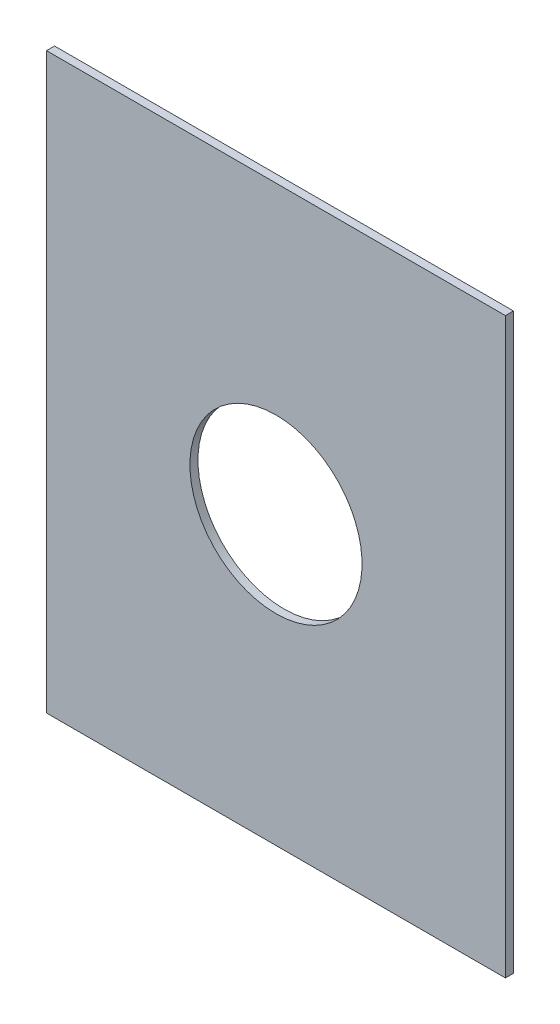
ISO-10303-21;
HEADER;
FILE_DESCRIPTION(('STEP AP214'),'2;1');
FILE_NAME('part.step','',(''),(''),'','','');
FILE_SCHEMA(('AUTOMOTIVE_DESIGN { 1 0 10303 214 1 1 1 1 }'));
ENDSEC;
DATA;
#1=APPLICATION_CONTEXT('core data for automotive mechanical design processes');
#2=APPLICATION_PROTOCOL_DEFINITION('international standard','automotive_design',2000,#1);
#3=PRODUCT_CONTEXT('',#1,'mechanical');
#4=PRODUCT('Part','Part','',(#3));
#5=PRODUCT_RELATED_PRODUCT_CATEGORY('part','',(#4));
#6=PRODUCT_DEFINITION_FORMATION('','',#4);
#7=PRODUCT_DEFINITION_CONTEXT('part definition',#1,'design');
#8=PRODUCT_DEFINITION('design','',#6,#7);
#9=PRODUCT_DEFINITION_SHAPE('','',#8);
#10=(LENGTH_UNIT() NAMED_UNIT(*) SI_UNIT(.MILLI.,.METRE.));
#11=(NAMED_UNIT(*) PLANE_ANGLE_UNIT() SI_UNIT($,.RADIAN.));
#12=(NAMED_UNIT(*) SI_UNIT($,.STERADIAN.) SOLID_ANGLE_UNIT());
#13=UNCERTAINTY_MEASURE_WITH_UNIT(LENGTH_MEASURE(1.E-05),#10,'distance_accuracy_value','');
#14=(GEOMETRIC_REPRESENTATION_CONTEXT(3) GLOBAL_UNCERTAINTY_ASSIGNED_CONTEXT((#13)) GLOBAL_UNIT_ASSIGNED_CONTEXT((#10,
#11,#12)) REPRESENTATION_CONTEXT('',''));
#15=CARTESIAN_POINT('',(0.,0.,0.));
#16=DIRECTION('',(0.,0.,1.));
#17=DIRECTION('',(1.,0.,0.));
#18=AXIS2_PLACEMENT_3D('',#15,#16,#17);
#19=CARTESIAN_POINT('',(121.92,-103.632,-0.045));
#20=DIRECTION('',(0.,0.,-1.));
#21=DIRECTION('',(0.,-1.,0.));
#22=AXIS2_PLACEMENT_3D('',#19,#20,#21);
#23=CYLINDRICAL_SURFACE('',#22,0.375);
#24=CARTESIAN_POINT('',(121.92,-103.632,1.67));
#25=DIRECTION('',(0.,0.,-1.));
#26=DIRECTION('',(0.,-1.,0.));
#27=AXIS2_PLACEMENT_3D('',#24,#25,#26);
#28=CIRCLE('',#27,0.375);
#29=CARTESIAN_POINT('',(121.92,-104.007,1.67));
#30=VERTEX_POINT('',#29);
#31=EDGE_CURVE('E123',#30,#30,#28,.T.);
#32=ORIENTED_EDGE('',*,*,#31,.T.);
#33=DIRECTION('',(0.,0.,1.));
#34=VECTOR('',#33,1.);
#35=CARTESIAN_POINT('',(121.92,-104.007,-0.045));
#36=LINE('',#35,#34);
#37=CARTESIAN_POINT('',(121.92,-104.007,1.705));
#38=VERTEX_POINT('',#37);
#39=EDGE_CURVE('E11',#30,#38,#36,.T.);
#40=ORIENTED_EDGE('',*,*,#39,.T.);
#41=CARTESIAN_POINT('',(121.92,-103.632,1.705));
#42=DIRECTION('',(0.,0.,-1.));
#43=DIRECTION('',(0.,-1.,0.));
#44=AXIS2_PLACEMENT_3D('',#41,#42,#43);
#45=CIRCLE('',#44,0.375);
#46=EDGE_CURVE('E21',#38,#38,#45,.T.);
#47=ORIENTED_EDGE('',*,*,#46,.F.);
#48=ORIENTED_EDGE('',*,*,#39,.F.);
#49=EDGE_LOOP('',(#32,#40,#47,#48));
#50=FACE_BOUND('',#49,.T.);
#51=ADVANCED_FACE('F17',(#50),#23,.F.);
#52=CARTESIAN_POINT('',(120.92,-102.382,1.67));
#53=DIRECTION('',(0.,1.,0.));
#54=DIRECTION('',(1.,0.,0.));
#55=AXIS2_PLACEMENT_3D('',#52,#53,#54);
#56=PLANE('',#55);
#57=DIRECTION('',(0.,0.,1.));
#58=VECTOR('',#57,1.);
#59=CARTESIAN_POINT('',(120.92,-102.382,1.67));
#60=LINE('',#59,#58);
#61=CARTESIAN_POINT('',(120.92,-102.382,1.67));
#62=VERTEX_POINT('',#61);
#63=CARTESIAN_POINT('',(120.92,-102.382,1.705));
#64=VERTEX_POINT('',#63);
#65=EDGE_CURVE('E118',#62,#64,#60,.T.);
#66=ORIENTED_EDGE('',*,*,#65,.T.);
#67=DIRECTION('',(1.,0.,0.));
#68=VECTOR('',#67,1.);
#69=CARTESIAN_POINT('',(120.92,-102.382,1.705));
#70=LINE('',#69,#68);
#71=CARTESIAN_POINT('',(122.92,-102.382,1.705));
#72=VERTEX_POINT('',#71);
#73=EDGE_CURVE('E133',#64,#72,#70,.T.);
#74=ORIENTED_EDGE('',*,*,#73,.T.);
#75=DIRECTION('',(0.,0.,1.));
#76=VECTOR('',#75,1.);
#77=CARTESIAN_POINT('',(122.92,-102.382,1.67));
#78=LINE('',#77,#76);
#79=CARTESIAN_POINT('',(122.92,-102.382,1.67));
#80=VERTEX_POINT('',#79);
#81=EDGE_CURVE('E100',#80,#72,#78,.T.);
#82=ORIENTED_EDGE('',*,*,#81,.F.);
#83=DIRECTION('',(1.,0.,0.));
#84=VECTOR('',#83,1.);
#85=CARTESIAN_POINT('',(120.92,-102.382,1.67));
#86=LINE('',#85,#84);
#87=EDGE_CURVE('E83',#62,#80,#86,.T.);
#88=ORIENTED_EDGE('',*,*,#87,.F.);
#89=EDGE_LOOP('',(#66,#74,#82,#88));
#90=FACE_BOUND('',#89,.T.);
#91=ADVANCED_FACE('F145',(#90),#56,.T.);
#92=CARTESIAN_POINT('',(0.,0.,1.705));
#93=DIRECTION('',(0.,0.,1.));
#94=DIRECTION('',(1.,0.,0.));
#95=AXIS2_PLACEMENT_3D('',#92,#93,#94);
#96=PLANE('',#95);
#97=ORIENTED_EDGE('',*,*,#46,.T.);
#98=EDGE_LOOP('',(#97));
#99=FACE_BOUND('',#98,.T.);
#100=DIRECTION('',(-1.,0.,0.));
#101=VECTOR('',#100,1.);
#102=CARTESIAN_POINT('',(122.92,-104.882,1.705));
#103=LINE('',#102,#101);
#104=CARTESIAN_POINT('',(122.92,-104.882,1.705));
#105=VERTEX_POINT('',#104);
#106=CARTESIAN_POINT('',(120.92,-104.882,1.705));
#107=VERTEX_POINT('',#106);
#108=EDGE_CURVE('E106',#105,#107,#103,.T.);
#109=ORIENTED_EDGE('',*,*,#108,.F.);
#110=DIRECTION('',(0.,-1.,0.));
#111=VECTOR('',#110,1.);
#112=CARTESIAN_POINT('',(122.92,-102.382,1.705));
#113=LINE('',#112,#111);
#114=EDGE_CURVE('E90',#72,#105,#113,.T.);
#115=ORIENTED_EDGE('',*,*,#114,.F.);
#116=ORIENTED_EDGE('',*,*,#73,.F.);
#117=DIRECTION('',(0.,1.,0.));
#118=VECTOR('',#117,1.);
#119=CARTESIAN_POINT('',(120.92,-104.882,1.705));
#120=LINE('',#119,#118);
#121=EDGE_CURVE('E89',#107,#64,#120,.T.);
#122=ORIENTED_EDGE('',*,*,#121,.F.);
#123=EDGE_LOOP('',(#109,#115,#116,#122));
#124=FACE_BOUND('',#123,.T.);
#125=ADVANCED_FACE('F19',(#99,#124),#96,.T.);
#126=CARTESIAN_POINT('',(0.,0.,1.67));
#127=DIRECTION('',(0.,0.,1.));
#128=DIRECTION('',(1.,0.,0.));
#129=AXIS2_PLACEMENT_3D('',#126,#127,#128);
#130=PLANE('',#129);
#131=ORIENTED_EDGE('',*,*,#31,.F.);
#132=EDGE_LOOP('',(#131));
#133=FACE_BOUND('',#132,.T.);
#134=DIRECTION('',(0.,1.,0.));
#135=VECTOR('',#134,1.);
#136=CARTESIAN_POINT('',(120.92,-104.882,1.67));
#137=LINE('',#136,#135);
#138=CARTESIAN_POINT('',(120.92,-104.882,1.67));
#139=VERTEX_POINT('',#138);
#140=EDGE_CURVE('E124',#139,#62,#137,.T.);
#141=ORIENTED_EDGE('',*,*,#140,.T.);
#142=ORIENTED_EDGE('',*,*,#87,.T.);
#143=DIRECTION('',(0.,-1.,0.));
#144=VECTOR('',#143,1.);
#145=CARTESIAN_POINT('',(122.92,-102.382,1.67));
#146=LINE('',#145,#144);
#147=CARTESIAN_POINT('',(122.92,-104.882,1.67));
#148=VERTEX_POINT('',#147);
#149=EDGE_CURVE('E77',#80,#148,#146,.T.);
#150=ORIENTED_EDGE('',*,*,#149,.T.);
#151=DIRECTION('',(-1.,0.,0.));
#152=VECTOR('',#151,1.);
#153=CARTESIAN_POINT('',(122.92,-104.882,1.67));
#154=LINE('',#153,#152);
#155=EDGE_CURVE('E81',#148,#139,#154,.T.);
#156=ORIENTED_EDGE('',*,*,#155,.T.);
#157=EDGE_LOOP('',(#141,#142,#150,#156));
#158=FACE_BOUND('',#157,.T.);
#159=ADVANCED_FACE('F80',(#133,#158),#130,.F.);
#160=CARTESIAN_POINT('',(120.92,-104.882,1.67));
#161=DIRECTION('',(-1.,0.,0.));
#162=DIRECTION('',(0.,0.,1.));
#163=AXIS2_PLACEMENT_3D('',#160,#161,#162);
#164=PLANE('',#163);
#165=DIRECTION('',(0.,0.,1.));
#166=VECTOR('',#165,1.);
#167=CARTESIAN_POINT('',(120.92,-104.882,1.67));
#168=LINE('',#167,#166);
#169=EDGE_CURVE('E98',#139,#107,#168,.T.);
#170=ORIENTED_EDGE('',*,*,#169,.T.);
#171=ORIENTED_EDGE('',*,*,#121,.T.);
#172=ORIENTED_EDGE('',*,*,#65,.F.);
#173=ORIENTED_EDGE('',*,*,#140,.F.);
#174=EDGE_LOOP('',(#170,#171,#172,#173));
#175=FACE_BOUND('',#174,.T.);
#176=ADVANCED_FACE('F154',(#175),#164,.T.);
#177=CARTESIAN_POINT('',(122.92,-102.382,1.67));
#178=DIRECTION('',(1.,0.,0.));
#179=DIRECTION('',(0.,1.,0.));
#180=AXIS2_PLACEMENT_3D('',#177,#178,#179);
#181=PLANE('',#180);
#182=ORIENTED_EDGE('',*,*,#81,.T.);
#183=ORIENTED_EDGE('',*,*,#114,.T.);
#184=DIRECTION('',(0.,0.,1.));
#185=VECTOR('',#184,1.);
#186=CARTESIAN_POINT('',(122.92,-104.882,1.67));
#187=LINE('',#186,#185);
#188=EDGE_CURVE('E96',#148,#105,#187,.T.);
#189=ORIENTED_EDGE('',*,*,#188,.F.);
#190=ORIENTED_EDGE('',*,*,#149,.F.);
#191=EDGE_LOOP('',(#182,#183,#189,#190));
#192=FACE_BOUND('',#191,.T.);
#193=ADVANCED_FACE('F102',(#192),#181,.T.);
#194=CARTESIAN_POINT('',(122.92,-104.882,1.67));
#195=DIRECTION('',(0.,-1.,0.));
#196=DIRECTION('',(0.,0.,-1.));
#197=AXIS2_PLACEMENT_3D('',#194,#195,#196);
#198=PLANE('',#197);
#199=ORIENTED_EDGE('',*,*,#188,.T.);
#200=ORIENTED_EDGE('',*,*,#108,.T.);
#201=ORIENTED_EDGE('',*,*,#169,.F.);
#202=ORIENTED_EDGE('',*,*,#155,.F.);
#203=EDGE_LOOP('',(#199,#200,#201,#202));
#204=FACE_BOUND('',#203,.T.);
#205=ADVANCED_FACE('F94',(#204),#198,.T.);
#206=CLOSED_SHELL('',(#51,#91,#125,#159,#176,#193,#205));
#207=MANIFOLD_SOLID_BREP('B1',#206);
#208=ADVANCED_BREP_SHAPE_REPRESENTATION('',(#18,#207),#14);
#209=SHAPE_DEFINITION_REPRESENTATION(#9,#208);
ENDSEC;
END-ISO-10303-21;
